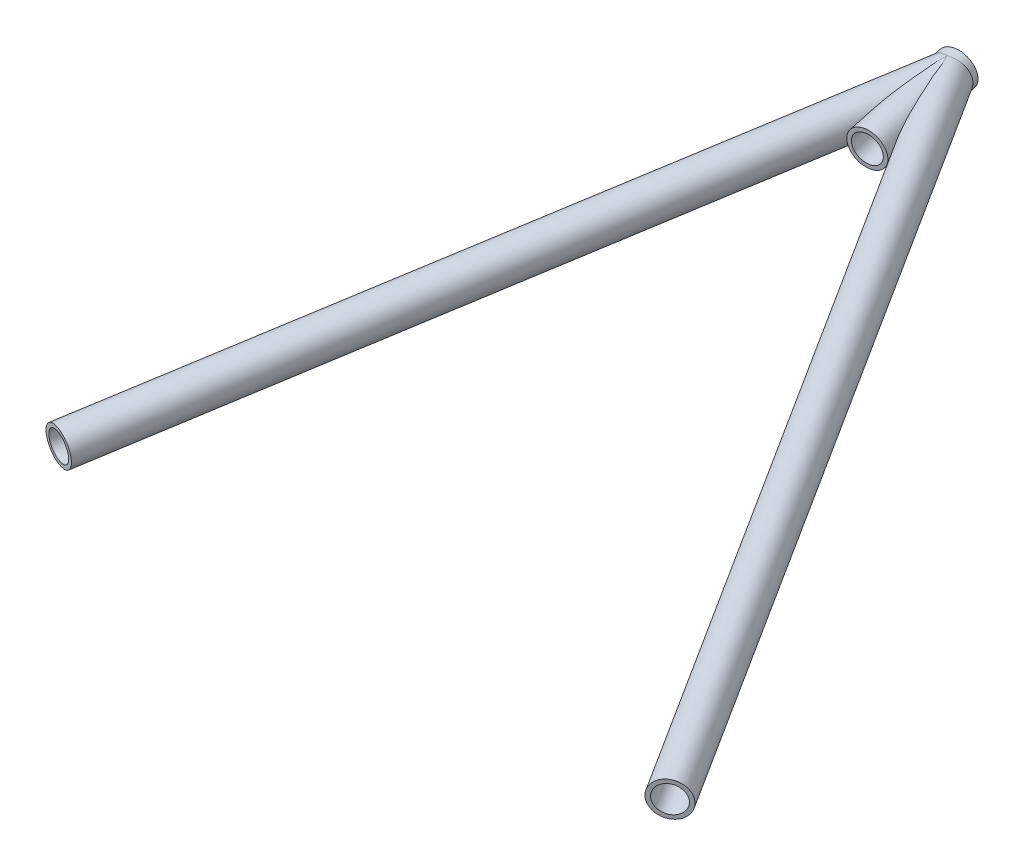
ISO-10303-21;
HEADER;
FILE_DESCRIPTION(('STEP AP214'),'2;1');
FILE_NAME('part.step','',(''),(''),'','','');
FILE_SCHEMA(('AUTOMOTIVE_DESIGN { 1 0 10303 214 1 1 1 1 }'));
ENDSEC;
DATA;
#1=APPLICATION_CONTEXT('core data for automotive mechanical design processes');
#2=APPLICATION_PROTOCOL_DEFINITION('international standard','automotive_design',2000,#1);
#3=PRODUCT_CONTEXT('',#1,'mechanical');
#4=PRODUCT('Part','Part','',(#3));
#5=PRODUCT_RELATED_PRODUCT_CATEGORY('part','',(#4));
#6=PRODUCT_DEFINITION_FORMATION('','',#4);
#7=PRODUCT_DEFINITION_CONTEXT('part definition',#1,'design');
#8=PRODUCT_DEFINITION('design','',#6,#7);
#9=PRODUCT_DEFINITION_SHAPE('','',#8);
#10=(LENGTH_UNIT() NAMED_UNIT(*) SI_UNIT(.MILLI.,.METRE.));
#11=(NAMED_UNIT(*) PLANE_ANGLE_UNIT() SI_UNIT($,.RADIAN.));
#12=(NAMED_UNIT(*) SI_UNIT($,.STERADIAN.) SOLID_ANGLE_UNIT());
#13=UNCERTAINTY_MEASURE_WITH_UNIT(LENGTH_MEASURE(1.E-05),#10,'distance_accuracy_value','');
#14=(GEOMETRIC_REPRESENTATION_CONTEXT(3) GLOBAL_UNCERTAINTY_ASSIGNED_CONTEXT((#13)) GLOBAL_UNIT_ASSIGNED_CONTEXT((#10,
#11,#12)) REPRESENTATION_CONTEXT('',''));
#15=CARTESIAN_POINT('',(0.,0.,0.));
#16=DIRECTION('',(0.,0.,1.));
#17=DIRECTION('',(1.,0.,0.));
#18=AXIS2_PLACEMENT_3D('',#15,#16,#17);
#19=CARTESIAN_POINT('',(1713.17260085528,131.13395858879,-611.724588998966));
#20=DIRECTION('',(0.512976736373104,-0.08229223970805,0.854448860508241));
#21=DIRECTION('',(0.857356807637054,0.,-0.514722550893585));
#22=AXIS2_PLACEMENT_3D('',#19,#20,#21);
#23=CYLINDRICAL_SURFACE('',#22,7.41680000000008);
#24=CARTESIAN_POINT('',(1932.04581422694,96.0220993887043,-247.154513007892));
#25=DIRECTION('',(-0.512976736373104,0.08229223970805,-0.854448860508241));
#26=DIRECTION('',(-0.857356807637054,0.,0.514722550893586));
#27=AXIS2_PLACEMENT_3D('',#24,#25,#26);
#28=CIRCLE('',#27,7.41680000000008);
#29=CARTESIAN_POINT('',(1925.68697025606,96.0220993887043,-243.336918792425));
#30=VERTEX_POINT('',#29);
#31=EDGE_CURVE('E107',#30,#30,#28,.T.);
#32=ORIENTED_EDGE('',*,*,#31,.F.);
#33=EDGE_LOOP('',(#32));
#34=FACE_BOUND('',#33,.T.);
#35=CARTESIAN_POINT('',(1723.05245629101,130.569114417633,-609.67734759782));
#36=CARTESIAN_POINT('',(1723.04654033207,130.377313286253,-609.687200454973));
#37=CARTESIAN_POINT('',(1723.03558764211,130.185341941127,-609.69093369608));
#38=CARTESIAN_POINT('',(1723.00385380998,129.802365240826,-609.685933915555));
#39=CARTESIAN_POINT('',(1722.98307189629,129.611359962669,-609.677199915247));
#40=CARTESIAN_POINT('',(1722.93212499311,129.231534671491,-609.646968784082));
#41=CARTESIAN_POINT('',(1722.90195592902,129.042715644421,-609.625466107161));
#42=CARTESIAN_POINT('',(1722.83291511719,128.668650539318,-609.569351607622));
#43=CARTESIAN_POINT('',(1722.79404354829,128.483404387946,-609.534740054384));
#44=CARTESIAN_POINT('',(1722.70843547749,128.117462600462,-609.451961973841));
#45=CARTESIAN_POINT('',(1722.66168551312,127.936775372678,-609.403772147867));
#46=CARTESIAN_POINT('',(1722.56153597079,127.581583555824,-609.293487379942));
#47=CARTESIAN_POINT('',(1722.50813634281,127.407079013274,-609.231392333392));
#48=CARTESIAN_POINT('',(1722.39615048155,127.065633452883,-609.093018034236));
#49=CARTESIAN_POINT('',(1722.33756721158,126.898688195146,-609.016746858512));
#50=CARTESIAN_POINT('',(1722.2168725192,126.573493043463,-608.849811285011));
#51=CARTESIAN_POINT('',(1722.15476126118,126.4152427451,-608.75914755742));
#52=CARTESIAN_POINT('',(1722.03096793333,126.113581909962,-608.566666492679));
#53=CARTESIAN_POINT('',(1721.9693382336,125.969855341315,-608.465310775417));
#54=CARTESIAN_POINT('',(1721.84639402671,125.69246511348,-608.249490273213));
#55=CARTESIAN_POINT('',(1721.78507950636,125.558801029791,-608.135026041785));
#56=CARTESIAN_POINT('',(1721.6646334476,125.302229610049,-607.893701630239));
#57=CARTESIAN_POINT('',(1721.605500971,125.179317619152,-607.766846865136));
#58=CARTESIAN_POINT('',(1721.49109552052,124.944525445904,-607.501715808001));
#59=CARTESIAN_POINT('',(1721.43582251283,124.832645166901,-607.363439616053));
#60=CARTESIAN_POINT('',(1721.33272886828,124.62429339617,-607.08269192494));
#61=CARTESIAN_POINT('',(1721.28469512182,124.527377197724,-606.940627421208));
#62=CARTESIAN_POINT('',(1721.1944119778,124.343384449913,-606.648543716566));
#63=CARTESIAN_POINT('',(1721.15216235441,124.256307516429,-606.498524826525));
#64=CARTESIAN_POINT('',(1721.07401202636,124.091430651227,-606.191864833834));
#65=CARTESIAN_POINT('',(1721.03811255351,124.013632520363,-606.035222453641));
#66=CARTESIAN_POINT('',(1720.97290333528,123.866616183222,-605.716645225286));
#67=CARTESIAN_POINT('',(1720.94359437323,123.79739899727,-605.55470975063));
#68=CARTESIAN_POINT('',(1720.8723843643,123.618606141324,-605.105911152147));
#69=CARTESIAN_POINT('',(1720.8371028269,123.516842924207,-604.814860950483));
#70=CARTESIAN_POINT('',(1720.78486574778,123.332410416336,-604.225156376746));
#71=CARTESIAN_POINT('',(1720.76792462366,123.249756187447,-603.926496210882));
#72=CARTESIAN_POINT('',(1720.75001694083,123.099486354441,-603.323894738933));
#73=CARTESIAN_POINT('',(1720.74910718808,123.031925065264,-603.019938471706));
#74=CARTESIAN_POINT('',(1720.75800604177,122.939832762813,-602.562493183076));
#75=CARTESIAN_POINT('',(1720.76268164796,122.910680083328,-602.409779309495));
#76=CARTESIAN_POINT('',(1720.77516899961,122.855135393918,-602.103974616504));
#77=CARTESIAN_POINT('',(1720.78298075231,122.82874339037,-601.950883796225));
#78=CARTESIAN_POINT('',(1720.80739152397,122.762324185192,-601.546358914043));
#79=CARTESIAN_POINT('',(1720.8264142541,122.724388011887,-601.294726988632));
#80=CARTESIAN_POINT('',(1720.87111220495,122.65413671667,-600.791254220738));
#81=CARTESIAN_POINT('',(1720.8967883909,122.621822411471,-600.539413353232));
#82=CARTESIAN_POINT('',(1720.95389437639,122.561995653237,-600.035689549966));
#83=CARTESIAN_POINT('',(1720.9853271153,122.534485667431,-599.783806658695));
#84=CARTESIAN_POINT('',(1721.05316611682,122.48365476674,-599.280282222038));
#85=CARTESIAN_POINT('',(1721.08957269973,122.460334121856,-599.028640693247));
#86=CARTESIAN_POINT('',(1721.20541931619,122.395777024535,-598.273050362963));
#87=CARTESIAN_POINT('',(1721.2913459101,122.360080490864,-597.769617080901));
#88=CARTESIAN_POINT('',(1721.47626198241,122.300612219466,-596.764658809902));
#89=CARTESIAN_POINT('',(1721.57524807191,122.27683739574,-596.263133360506));
#90=CARTESIAN_POINT('',(1721.78436439084,122.23932364899,-595.256904932338));
#91=CARTESIAN_POINT('',(1721.89459453669,122.225685601338,-594.752219132698));
#92=CARTESIAN_POINT('',(1722.12312635943,122.207789909182,-593.744498828002));
#93=CARTESIAN_POINT('',(1722.24142849574,122.203532799068,-593.241464418647));
#94=CARTESIAN_POINT('',(1722.48418017973,122.203856314525,-592.237913525998));
#95=CARTESIAN_POINT('',(1722.60861748857,122.208419987753,-591.737394062699));
#96=CARTESIAN_POINT('',(1722.86255967634,122.226169051773,-590.737814713578));
#97=CARTESIAN_POINT('',(1722.99206442808,122.239354226298,-590.238754791459));
#98=CARTESIAN_POINT('',(1723.28100577327,122.277897595185,-589.143972763658));
#99=CARTESIAN_POINT('',(1723.44131906471,122.305140156573,-588.548547422757));
#100=CARTESIAN_POINT('',(1723.76638569234,122.372789546001,-587.359614267569));
#101=CARTESIAN_POINT('',(1723.93113933475,122.413197284102,-586.766106588708));
#102=CARTESIAN_POINT('',(1724.26445112291,122.508571585529,-585.579406274474));
#103=CARTESIAN_POINT('',(1724.43301911512,122.563581033968,-584.986219810543));
#104=CARTESIAN_POINT('',(1724.77245515445,122.690081235806,-583.802371953746));
#105=CARTESIAN_POINT('',(1724.9433227723,122.761568952329,-583.211710116006));
#106=CARTESIAN_POINT('',(1725.28395037135,122.922852028021,-582.041913127049));
#107=CARTESIAN_POINT('',(1725.45369071435,123.012368096081,-581.46273469764));
#108=CARTESIAN_POINT('',(1725.70854870001,123.164262049089,-580.596887974645));
#109=CARTESIAN_POINT('',(1725.79357651002,123.217854859657,-580.308645039762));
#110=CARTESIAN_POINT('',(1725.96352599184,123.331737476364,-579.733454324624));
#111=CARTESIAN_POINT('',(1726.04844766716,123.392027054658,-579.446506500651));
#112=CARTESIAN_POINT('',(1726.21759670224,123.520037674093,-578.875547402489));
#113=CARTESIAN_POINT('',(1726.30182546207,123.587723554968,-578.591528703547));
#114=CARTESIAN_POINT('',(1726.4697104338,123.732098336937,-578.025622766102));
#115=CARTESIAN_POINT('',(1726.55336669129,123.808786512203,-577.743735357707));
#116=CARTESIAN_POINT('',(1726.71963907114,123.972912544411,-577.183196215688));
#117=CARTESIAN_POINT('',(1726.80225637319,124.060336709565,-576.904540846769));
#118=CARTESIAN_POINT('',(1726.96599963226,124.248574245335,-576.351380074664));
#119=CARTESIAN_POINT('',(1727.04712620244,124.349381964134,-576.076872973887));
#120=CARTESIAN_POINT('',(1727.14692251124,124.486025341449,-575.7380825857));
#121=CARTESIAN_POINT('',(1727.16671393903,124.513758726626,-575.670838503921));
#122=CARTESIAN_POINT('',(1727.2061294634,124.570382912259,-575.536787143864));
#123=CARTESIAN_POINT('',(1727.22575355519,124.599273745869,-575.469979878162));
#124=CARTESIAN_POINT('',(1727.28435196274,124.687820610514,-575.270262488974));
#125=CARTESIAN_POINT('',(1727.32304337925,124.749338742417,-575.138087416282));
#126=CARTESIAN_POINT('',(1727.39949081988,124.878245939998,-574.876121609656));
#127=CARTESIAN_POINT('',(1727.43724569603,124.945641793731,-574.746333847873));
#128=CARTESIAN_POINT('',(1727.51142644802,125.087293794141,-574.490227519062));
#129=CARTESIAN_POINT('',(1727.54785266501,125.161548162237,-574.363908063578));
#130=CARTESIAN_POINT('',(1727.63481611861,125.353286830789,-574.060510914929));
#131=CARTESIAN_POINT('',(1727.68440958377,125.475291895177,-573.885893473436));
#132=CARTESIAN_POINT('',(1727.75415421182,125.675294202062,-573.63650875239));
#133=CARTESIAN_POINT('',(1727.77661234912,125.744732936298,-573.555529408285));
#134=CARTESIAN_POINT('',(1727.81948762507,125.890180182632,-573.399161870165));
#135=CARTESIAN_POINT('',(1727.83990627244,125.966183759572,-573.323769553939));
#136=CARTESIAN_POINT('',(1727.88002988058,126.133948103504,-573.173052164775));
#137=CARTESIAN_POINT('',(1727.89944210014,126.226525571001,-573.098542132831));
#138=CARTESIAN_POINT('',(1727.93372089541,126.421592146569,-572.962511865748));
#139=CARTESIAN_POINT('',(1727.94859396864,126.524066807959,-572.900973102462));
#140=CARTESIAN_POINT('',(1727.9703688576,126.721305130092,-572.804172833107));
#141=CARTESIAN_POINT('',(1727.9781683592,126.814655300222,-572.766276163256));
#142=CARTESIAN_POINT('',(1727.9886360929,127.006497014591,-572.705943546994));
#143=CARTESIAN_POINT('',(1727.99131000185,127.104982746569,-572.683490513701));
#144=CARTESIAN_POINT('',(1727.99110333081,127.30466275826,-572.655718258056));
#145=CARTESIAN_POINT('',(1727.98820592868,127.405864328365,-572.650451056551));
#146=CARTESIAN_POINT('',(1727.97707313307,127.607437401087,-572.656874898471));
#147=CARTESIAN_POINT('',(1727.96883271801,127.707808032787,-572.66858190779));
#148=CARTESIAN_POINT('',(1727.94506210844,127.93076355568,-572.711846518752));
#149=CARTESIAN_POINT('',(1727.92819322461,128.052335118458,-572.747775707289));
#150=CARTESIAN_POINT('',(1727.88912348547,128.287701845822,-572.837620625341));
#151=CARTESIAN_POINT('',(1727.86691075087,128.401478949115,-572.89157653333));
#152=CARTESIAN_POINT('',(1727.82203384034,128.605973058439,-573.004270539063));
#153=CARTESIAN_POINT('',(1727.79983990089,128.697724245082,-573.061366303878));
#154=CARTESIAN_POINT('',(1727.75337965479,128.875670381991,-573.182972871904));
#155=CARTESIAN_POINT('',(1727.72911168024,128.96186076074,-573.247489657656));
#156=CARTESIAN_POINT('',(1727.67898802284,129.129385125038,-573.382324532379));
#157=CARTESIAN_POINT('',(1727.65312877933,129.210707352104,-573.45265576215));
#158=CARTESIAN_POINT('',(1727.60025467923,129.368843032192,-573.597718249923));
#159=CARTESIAN_POINT('',(1727.57324020902,129.445657972714,-573.672448039813));
#160=CARTESIAN_POINT('',(1727.50400492049,129.634361753042,-573.865271202049));
#161=CARTESIAN_POINT('',(1727.46119471828,129.743672367138,-573.985671502339));
#162=CARTESIAN_POINT('',(1727.37412769178,129.954798805285,-574.23241613044));
#163=CARTESIAN_POINT('',(1727.32987010012,130.056610557549,-574.358763627362));
#164=CARTESIAN_POINT('',(1727.24024816083,130.25407673097,-574.616167440291));
#165=CARTESIAN_POINT('',(1727.19488196415,130.349719737163,-574.747231824044));
#166=CARTESIAN_POINT('',(1727.10339164071,130.535605791726,-575.012882962832));
#167=CARTESIAN_POINT('',(1727.05726742402,130.625848193371,-575.147470136961));
#168=CARTESIAN_POINT('',(1726.96419798409,130.802161088826,-575.420224465398));
#169=CARTESIAN_POINT('',(1726.91724960088,130.888205239722,-575.558407506878));
#170=CARTESIAN_POINT('',(1726.82292803408,131.056178552793,-575.837109482565));
#171=CARTESIAN_POINT('',(1726.77555483459,131.138107560182,-575.977628504372));
#172=CARTESIAN_POINT('',(1726.68055076136,131.298234146016,-576.260438223727));
#173=CARTESIAN_POINT('',(1726.63292027664,131.376436193937,-576.402726527262));
#174=CARTESIAN_POINT('',(1726.53742703123,131.529605487745,-576.688947920995));
#175=CARTESIAN_POINT('',(1726.48956427451,131.604572788616,-576.832880983182));
#176=CARTESIAN_POINT('',(1726.34499967611,131.826243070369,-577.26898865864));
#177=CARTESIAN_POINT('',(1726.24803946553,131.968518096491,-577.563333408426));
#178=CARTESIAN_POINT('',(1726.05382647221,132.243381675934,-578.156436015282));
#179=CARTESIAN_POINT('',(1725.95657364764,132.375968768313,-578.455194529816));
#180=CARTESIAN_POINT('',(1725.76201376865,132.63297044007,-579.056367004211));
#181=CARTESIAN_POINT('',(1725.664706711,132.757380986967,-579.358782681936));
#182=CARTESIAN_POINT('',(1725.47029788569,132.999071352768,-579.966525491397));
#183=CARTESIAN_POINT('',(1725.37319612925,133.116350791504,-580.271852777352));
#184=CARTESIAN_POINT('',(1725.17915207025,133.344893093205,-580.885695794895));
#185=CARTESIAN_POINT('',(1725.08221069603,133.45614098482,-581.194217382211));
#186=CARTESIAN_POINT('',(1724.88888063237,133.672983142699,-581.813416551023));
#187=CARTESIAN_POINT('',(1724.79249195817,133.778577253542,-582.124094191524));
#188=CARTESIAN_POINT('',(1724.50444502648,134.087634640036,-583.058790705019));
#189=CARTESIAN_POINT('',(1724.31384217685,134.283446981898,-583.68567433358));
#190=CARTESIAN_POINT('',(1723.93686895751,134.657541361915,-584.945229958343));
#191=CARTESIAN_POINT('',(1723.7504950605,134.835838456078,-585.57789646304));
#192=CARTESIAN_POINT('',(1723.38318939233,135.177001527154,-586.849006701281));
#193=CARTESIAN_POINT('',(1723.20225810942,135.339866122437,-587.487450946495));
#194=CARTESIAN_POINT('',(1722.84786708533,135.651005369213,-588.768918344349));
#195=CARTESIAN_POINT('',(1722.67439715532,135.799300296471,-589.411933758914));
#196=CARTESIAN_POINT('',(1722.33699000706,136.08188502393,-590.703475440731));
#197=CARTESIAN_POINT('',(1722.17305190343,136.216176125836,-591.352001189706));
#198=CARTESIAN_POINT('',(1721.88774876259,136.446209178538,-592.531832471643));
#199=CARTESIAN_POINT('',(1721.76419403631,136.544439536494,-593.062122762843));
#200=CARTESIAN_POINT('',(1721.5278832215,136.730521618372,-594.127113710472));
#201=CARTESIAN_POINT('',(1721.41513000987,136.818370578741,-594.66181550091));
#202=CARTESIAN_POINT('',(1721.25669485208,136.941078243437,-595.467259549226));
#203=CARTESIAN_POINT('',(1721.20567214448,136.980464823488,-595.73626719979));
#204=CARTESIAN_POINT('',(1721.10774431697,137.055894834217,-596.275494325697));
#205=CARTESIAN_POINT('',(1721.06083905378,137.091938381242,-596.545713758522));
#206=CARTESIAN_POINT('',(1720.97180059786,137.160265669107,-597.087351620025));
#207=CARTESIAN_POINT('',(1720.92966628007,137.192550296421,-597.358769750276));
#208=CARTESIAN_POINT('',(1720.85094140363,137.25281788767,-597.902876119974));
#209=CARTESIAN_POINT('',(1720.81435057926,137.280801057791,-598.175564297895));
#210=CARTESIAN_POINT('',(1720.73779935068,137.339270311498,-598.802815188736));
#211=CARTESIAN_POINT('',(1720.70002641696,137.368061687218,-599.157812427505));
#212=CARTESIAN_POINT('',(1720.63780007058,137.415104339226,-599.86980885644));
#213=CARTESIAN_POINT('',(1720.61334964995,137.433353247891,-600.226808478138));
#214=CARTESIAN_POINT('',(1720.58089412748,137.456182895289,-600.941543828652));
#215=CARTESIAN_POINT('',(1720.57286492241,137.460783671366,-601.299277705975));
#216=CARTESIAN_POINT('',(1720.57684445117,137.451995329802,-602.014412921783));
#217=CARTESIAN_POINT('',(1720.5888405537,137.438617553472,-602.371814327721));
#218=CARTESIAN_POINT('',(1720.62728094086,137.397812353018,-602.94364577828));
#219=CARTESIAN_POINT('',(1720.64620477468,137.377961852585,-603.159123716042));
#220=CARTESIAN_POINT('',(1720.69358362457,137.327727439894,-603.587771761716));
#221=CARTESIAN_POINT('',(1720.72203547175,137.297347029626,-603.800942612632));
#222=CARTESIAN_POINT('',(1720.78890795805,137.224303600442,-604.22326985497));
#223=CARTESIAN_POINT('',(1720.82731262239,137.181660252263,-604.432432107867));
#224=CARTESIAN_POINT('',(1720.91415266722,137.082230302288,-604.845262561577));
#225=CARTESIAN_POINT('',(1720.96258603365,137.025446539838,-605.04893185627));
#226=CARTESIAN_POINT('',(1721.0606234992,136.906114628933,-605.417674337204));
#227=CARTESIAN_POINT('',(1721.10888200087,136.845824944191,-605.583835973428));
#228=CARTESIAN_POINT('',(1721.21131376055,136.713201416826,-605.909379685184));
#229=CARTESIAN_POINT('',(1721.26548584339,136.640869965699,-606.068763098999));
#230=CARTESIAN_POINT('',(1721.37857583728,136.483680020401,-606.379497782779));
#231=CARTESIAN_POINT('',(1721.43749415951,136.39882044037,-606.530848354961));
#232=CARTESIAN_POINT('',(1721.55856778639,136.216468401279,-606.824379270386));
#233=CARTESIAN_POINT('',(1721.62072316975,136.118975634999,-606.966559390491));
#234=CARTESIAN_POINT('',(1721.74662469165,135.91150064187,-607.241009108491));
#235=CARTESIAN_POINT('',(1721.81037246232,135.8015051529,-607.373267931014));
#236=CARTESIAN_POINT('',(1721.93760793841,135.569674836324,-607.627100692577));
#237=CARTESIAN_POINT('',(1722.00109563875,135.447839778569,-607.748674423824));
#238=CARTESIAN_POINT('',(1722.12611174923,135.193063895975,-607.980851517193));
#239=CARTESIAN_POINT('',(1722.18763896734,135.060116486008,-608.091448288288));
#240=CARTESIAN_POINT('',(1722.30709748487,134.78415020043,-608.301439824914));
#241=CARTESIAN_POINT('',(1722.36502878167,134.641131317514,-608.400834582319));
#242=CARTESIAN_POINT('',(1722.475145828,134.34807553776,-608.5871495931));
#243=CARTESIAN_POINT('',(1722.52739826433,134.198158618163,-608.674219388284));
#244=CARTESIAN_POINT('',(1722.6258899732,133.890641347062,-608.837505815819));
#245=CARTESIAN_POINT('',(1722.67212924149,133.733040990139,-608.913722440514));
#246=CARTESIAN_POINT('',(1722.75763864707,133.41130052742,-609.055370803047));
#247=CARTESIAN_POINT('',(1722.79691065637,133.247162192851,-609.12080543753));
#248=CARTESIAN_POINT('',(1722.86775060106,132.913411083176,-609.240995818702));
#249=CARTESIAN_POINT('',(1722.89931876247,132.743798468842,-609.295751878676));
#250=CARTESIAN_POINT('',(1722.95254974927,132.410446891782,-609.391690965734));
#251=CARTESIAN_POINT('',(1722.9746908399,132.246960449564,-609.433488491917));
#252=CARTESIAN_POINT('',(1723.01133528768,131.916973562253,-609.507713074967));
#253=CARTESIAN_POINT('',(1723.02583615056,131.750472151215,-609.540137070176));
#254=CARTESIAN_POINT('',(1723.0469838483,131.415397173538,-609.595571402671));
#255=CARTESIAN_POINT('',(1723.05362981834,131.246823380796,-609.61858070323));
#256=CARTESIAN_POINT('',(1723.05898350411,130.908582098071,-609.655106001696));
#257=CARTESIAN_POINT('',(1723.05769365864,130.738914960097,-609.668624914709));
#258=CARTESIAN_POINT('',(1723.05245629101,130.569114417633,-609.67734759782));
#259=B_SPLINE_CURVE_WITH_KNOTS('',3,(#35,#36,#37,#38,#39,#40,#41,#42,#43,#44,#45,#46,#47,#48,
#49,#50,#51,#52,#53,#54,#55,#56,#57,#58,#59,#60,#61,#62,#63,#64,#65,#66,#67,#68,#69,#70,#71,#72,
#73,#74,#75,#76,#77,#78,#79,#80,#81,#82,#83,#84,#85,#86,#87,#88,#89,#90,#91,#92,#93,#94,#95,#96,
#97,#98,#99,#100,#101,#102,#103,#104,#105,#106,#107,#108,#109,#110,#111,#112,#113,#114,#115,
#116,#117,#118,#119,#120,#121,#122,#123,#124,#125,#126,#127,#128,#129,#130,#131,#132,#133,#134,
#135,#136,#137,#138,#139,#140,#141,#142,#143,#144,#145,#146,#147,#148,#149,#150,#151,#152,#153,
#154,#155,#156,#157,#158,#159,#160,#161,#162,#163,#164,#165,#166,#167,#168,#169,#170,#171,#172,
#173,#174,#175,#176,#177,#178,#179,#180,#181,#182,#183,#184,#185,#186,#187,#188,#189,#190,#191,
#192,#193,#194,#195,#196,#197,#198,#199,#200,#201,#202,#203,#204,#205,#206,#207,#208,#209,#210,
#211,#212,#213,#214,#215,#216,#217,#218,#219,#220,#221,#222,#223,#224,#225,#226,#227,#228,#229,
#230,#231,#232,#233,#234,#235,#236,#237,#238,#239,#240,#241,#242,#243,#244,#245,#246,#247,#248,
#249,#250,#251,#252,#253,#254,#255,#256,#257,#258),.UNSPECIFIED.,.T.,.F.,(4,2,2,2,2,2,2,2,2,2,2,
2,2,2,2,2,2,2,2,2,2,2,2,2,2,2,2,2,2,2,2,2,2,2,2,2,2,2,2,2,2,2,2,2,2,2,2,2,2,2,2,2,2,2,2,2,2,2,2,
2,2,2,2,2,2,2,2,2,2,2,2,2,2,2,2,2,2,2,2,2,2,2,2,2,2,2,2,2,2,2,2,2,2,2,2,2,2,2,2,2,2,2,2,2,2,2,2,
2,2,2,2,4),(0.,0.5762905985785,1.15262643841304,1.72921279252587,2.30578729873162,
2.88335722553767,3.46093149720245,4.03817769780171,4.6153970269364,5.17374293840111,
5.73206528202877,6.2901447054839,6.84821923902869,7.38332139769753,7.91840265917229,
8.45358760228693,8.98883612112741,9.91821558798152,10.8483251209369,11.7817297668767,
12.248312295847,12.7148959022911,13.4802640933417,14.2457433798635,15.0116146248162,
15.7775352122352,17.3129644784832,18.8479960853233,20.3981061111411,21.9483044373709,
23.4955264560109,25.0427096648364,26.894241564471,28.7459014807718,30.6030610640594,
32.459878653906,34.289881738979,35.2056127640783,36.1213126427637,37.0328347320155,
37.9442833782823,38.8545814805171,39.7644963833476,39.9906376729429,40.2167854445226,
40.6691835878372,41.1221112955511,41.5749218759369,42.2294771016718,42.5562421436365,
42.8827636411422,43.2430896948133,43.602897517992,43.9047945559671,44.2063570346246,
44.5088314885144,44.8115906336242,45.1931073454155,45.5754801293267,45.9059684843568,
46.2367251587558,46.5682509340919,46.8996666764028,47.4037574122136,47.9081198753821,
48.4133903378055,48.9187211861735,49.426896527911,49.9350909696096,50.4426597895652,
50.9502199783058,51.972994654346,52.9959232479572,54.0193525981185,55.0428364607878,
56.0687542821779,57.0947002915324,59.145921824268,61.1953644200527,63.2449903239969,
65.2917222326139,67.3382637204383,68.9979468942732,70.6580708895933,71.4878942705656,
72.3176887604122,73.1472871597566,73.9768457805912,75.0509957550787,76.1253868682501,
77.1981998442995,78.2703363812202,78.9215935251996,79.5726342845615,80.2226364925022,
80.8725082872918,81.4216289862148,81.9706407594928,82.5197001456041,83.068772886459,
83.6184335829981,84.1681049664559,84.7181044239535,85.2681042804134,85.8107211981469,
86.3533384986249,86.8958097832951,87.4382651506712,87.9483864345856,88.4586741506583,
88.9690180434485,89.4792051083131),.UNSPECIFIED.);
#260=CARTESIAN_POINT('',(1723.05245629101,130.569114417633,-609.67734759782));
#261=VERTEX_POINT('',#260);
#262=EDGE_CURVE('E81',#261,#261,#259,.T.);
#263=ORIENTED_EDGE('',*,*,#262,.T.);
#264=EDGE_LOOP('',(#263));
#265=FACE_BOUND('',#264,.T.);
#266=ADVANCED_FACE('F63',(#34,#265),#23,.F.);
#267=CARTESIAN_POINT('',(1719.75176820433,126.102654339161,-562.415355233465));
#268=DIRECTION('',(-0.131583346980973,0.100626084992588,-0.98618467531003));
#269=DIRECTION('',(-0.991215775128284,0.,0.132254629925897));
#270=AXIS2_PLACEMENT_3D('',#267,#268,#269);
#271=CYLINDRICAL_SURFACE('',#270,9.52500000000004);
#272=ORIENTED_EDGE('',*,*,#262,.F.);
#273=EDGE_LOOP('',(#272));
#274=FACE_BOUND('',#273,.T.);
#275=CARTESIAN_POINT('',(1713.17260085528,131.13395858879,-611.724588998964));
#276=DIRECTION('',(0.944230002344393,0.0453897924229676,-0.326143326493902));
#277=DIRECTION('',(0.329060742994004,-0.0933834430453637,0.93968003064087));
#278=AXIS2_PLACEMENT_3D('',#275,#276,#277);
#279=ELLIPSE('',#278,47.1628036692757,9.525);
#280=CARTESIAN_POINT('',(1713.28876294306,121.660440805419,-612.706725536065));
#281=VERTEX_POINT('',#280);
#282=CARTESIAN_POINT('',(1713.05643876749,140.607476372162,-610.742452461863));
#283=VERTEX_POINT('',#282);
#284=EDGE_CURVE('E72',#281,#283,#279,.F.);
#285=ORIENTED_EDGE('',*,*,#284,.T.);
#286=CARTESIAN_POINT('',(1713.17260085528,131.13395858879,-611.724588998964));
#287=DIRECTION('',(0.329060742994004,-0.0933834430453637,0.93968003064087));
#288=DIRECTION('',(0.944230002344393,0.0453897924229676,-0.326143326493902));
#289=AXIS2_PLACEMENT_3D('',#286,#287,#288);
#290=ELLIPSE('',#289,9.72540390868764,9.525);
#291=EDGE_CURVE('E13',#283,#281,#290,.F.);
#292=ORIENTED_EDGE('',*,*,#291,.T.);
#293=EDGE_LOOP('',(#285,#292));
#294=FACE_BOUND('',#293,.T.);
#295=ADVANCED_FACE('F79',(#274,#294),#271,.F.);
#296=CARTESIAN_POINT('',(1713.17260085528,131.13395858879,-611.724588998966));
#297=DIRECTION('',(0.512976736373104,-0.08229223970805,0.854448860508241));
#298=DIRECTION('',(0.857356807637054,0.,-0.514722550893585));
#299=AXIS2_PLACEMENT_3D('',#296,#297,#298);
#300=CYLINDRICAL_SURFACE('',#299,9.52499999999996);
#301=CARTESIAN_POINT('',(1932.04581422694,96.0220993887043,-247.154513007892));
#302=DIRECTION('',(-0.512976736373104,0.08229223970805,-0.854448860508241));
#303=DIRECTION('',(-0.857356807637054,0.,0.514722550893586));
#304=AXIS2_PLACEMENT_3D('',#301,#302,#303);
#305=CIRCLE('',#304,9.52499999999996);
#306=CARTESIAN_POINT('',(1923.8794906342,96.0220993887043,-242.251780710631));
#307=VERTEX_POINT('',#306);
#308=EDGE_CURVE('E67',#307,#307,#305,.T.);
#309=ORIENTED_EDGE('',*,*,#308,.T.);
#310=EDGE_LOOP('',(#309));
#311=FACE_BOUND('',#310,.T.);
#312=ORIENTED_EDGE('',*,*,#284,.F.);
#313=ORIENTED_EDGE('',*,*,#291,.F.);
#314=EDGE_LOOP('',(#312,#313));
#315=FACE_BOUND('',#314,.T.);
#316=ADVANCED_FACE('F65',(#311,#315),#300,.T.);
#317=CARTESIAN_POINT('',(1932.04581422694,96.0220993887044,-247.154513007892));
#318=DIRECTION('',(-0.512976736373104,0.08229223970805,-0.854448860508241));
#319=DIRECTION('',(-0.857356807637054,0.,0.514722550893586));
#320=AXIS2_PLACEMENT_3D('',#317,#318,#319);
#321=PLANE('',#320);
#322=ORIENTED_EDGE('',*,*,#31,.T.);
#323=EDGE_LOOP('',(#322));
#324=FACE_BOUND('',#323,.T.);
#325=ORIENTED_EDGE('',*,*,#308,.F.);
#326=EDGE_LOOP('',(#325));
#327=FACE_BOUND('',#326,.T.);
#328=ADVANCED_FACE('F84',(#324,#327),#321,.F.);
#329=CLOSED_SHELL('',(#266,#295,#316,#328));
#330=MANIFOLD_SOLID_BREP('B2',#329);
#331=CARTESIAN_POINT('',(1600.,88.8502518080079,-217.248802890104));
#332=DIRECTION('',(0.274316838299431,0.102490644096067,-0.956162088820811));
#333=DIRECTION('',(-0.961223924389069,0.,-0.275769046816492));
#334=AXIS2_PLACEMENT_3D('',#331,#332,#333);
#335=CYLINDRICAL_SURFACE('',#334,7.41680000000008);
#336=CARTESIAN_POINT('',(1609.60108934048,92.4374243513702,-250.714475998832));
#337=DIRECTION('',(0.274316838299431,0.102490644096067,-0.956162088820811));
#338=DIRECTION('',(-0.96122392438907,0.,-0.275769046816492));
#339=AXIS2_PLACEMENT_3D('',#336,#337,#338);
#340=CIRCLE('',#339,7.41680000000008);
#341=CARTESIAN_POINT('',(1602.47188373807,92.4374243513702,-252.759799865261));
#342=VERTEX_POINT('',#341);
#343=EDGE_CURVE('E161',#342,#342,#340,.T.);
#344=ORIENTED_EDGE('',*,*,#343,.F.);
#345=EDGE_LOOP('',(#344));
#346=FACE_BOUND('',#345,.T.);
#347=CARTESIAN_POINT('',(1704.16915790004,130.433703385095,-607.237048483694));
#348=CARTESIAN_POINT('',(1704.16399077324,130.626588998975,-607.219033881927));
#349=CARTESIAN_POINT('',(1704.16540530266,130.819281558209,-607.196394251857));
#350=CARTESIAN_POINT('',(1704.1813770738,131.202905341836,-607.141967483448));
#351=CARTESIAN_POINT('',(1704.19594213303,131.393835450306,-607.11017491168));
#352=CARTESIAN_POINT('',(1704.23805567209,131.772948573631,-607.037340005222));
#353=CARTESIAN_POINT('',(1704.26563419309,131.961124188121,-606.996276383592));
#354=CARTESIAN_POINT('',(1704.33337705444,132.332881747878,-606.904804568348));
#355=CARTESIAN_POINT('',(1704.37354129535,132.516463729427,-606.854396448566));
#356=CARTESIAN_POINT('',(1704.46585660825,132.877707098577,-606.743964816532));
#357=CARTESIAN_POINT('',(1704.51801205661,133.055366297404,-606.683937796158));
#358=CARTESIAN_POINT('',(1704.63346009951,133.403286266749,-606.553931925536));
#359=CARTESIAN_POINT('',(1704.69675315362,133.573546731618,-606.48395266466));
#360=CARTESIAN_POINT('',(1704.83331810417,133.905100084552,-606.33369454951));
#361=CARTESIAN_POINT('',(1704.90658128143,134.066400636664,-606.253424698183));
#362=CARTESIAN_POINT('',(1705.06175584714,134.378797186812,-606.082104958726));
#363=CARTESIAN_POINT('',(1705.14366685982,134.529893627774,-605.991055538972));
#364=CARTESIAN_POINT('',(1705.31230561934,134.816867969547,-605.800247785144));
#365=CARTESIAN_POINT('',(1705.39885802946,134.953035062472,-605.700769615719));
#366=CARTESIAN_POINT('',(1705.57681119888,135.213328221495,-605.490980346471));
#367=CARTESIAN_POINT('',(1705.66821180405,135.337454669997,-605.380669590911));
#368=CARTESIAN_POINT('',(1705.85382700765,135.572722291596,-605.14926990721));
#369=CARTESIAN_POINT('',(1705.94804002065,135.68387061347,-605.02818697812));
#370=CARTESIAN_POINT('',(1706.13725119627,135.892690198147,-604.775482834942));
#371=CARTESIAN_POINT('',(1706.23224932658,135.990362012752,-604.64386205268));
#372=CARTESIAN_POINT('',(1706.41567781871,136.166926011533,-604.378432153677));
#373=CARTESIAN_POINT('',(1706.50417605965,136.2465673442,-604.245166606849));
#374=CARTESIAN_POINT('',(1706.67857074584,136.393926755853,-603.970580827279));
#375=CARTESIAN_POINT('',(1706.76446696554,136.461643803552,-603.829259899254));
#376=CARTESIAN_POINT('',(1706.93239928544,136.585669705703,-603.539554155033));
#377=CARTESIAN_POINT('',(1707.0144360059,136.641980398076,-603.391170481633));
#378=CARTESIAN_POINT('',(1707.17378151406,136.744005633777,-603.088357015416));
#379=CARTESIAN_POINT('',(1707.25108965166,136.789718722529,-602.93392639602));
#380=CARTESIAN_POINT('',(1707.44038371105,136.893396174057,-602.536022305));
#381=CARTESIAN_POINT('',(1707.54878656909,136.944824515549,-602.289125749296));
#382=CARTESIAN_POINT('',(1707.75247874519,137.028694357763,-601.786850906199));
#383=CARTESIAN_POINT('',(1707.84776019078,137.061124497766,-601.531467640095));
#384=CARTESIAN_POINT('',(1708.02604618595,137.110606759745,-601.013989913246));
#385=CARTESIAN_POINT('',(1708.10900409329,137.127601643368,-600.751874149483));
#386=CARTESIAN_POINT('',(1708.22473684975,137.143669300373,-600.355899556627));
#387=CARTESIAN_POINT('',(1708.26186164549,137.147454467461,-600.223449800737));
#388=CARTESIAN_POINT('',(1708.33338801329,137.152200737703,-599.957761109431));
#389=CARTESIAN_POINT('',(1708.36778954049,137.15316179436,-599.824522161058));
#390=CARTESIAN_POINT('',(1708.44942647965,137.152409095601,-599.495357474075));
#391=CARTESIAN_POINT('',(1708.49519756677,137.14924493869,-599.299071555874));
#392=CARTESIAN_POINT('',(1708.58177429116,137.138250861155,-598.905529270086));
#393=CARTESIAN_POINT('',(1708.6225792987,137.130420349541,-598.708272782716));
#394=CARTESIAN_POINT('',(1708.73833105913,137.10090371449,-598.115329075253));
#395=CARTESIAN_POINT('',(1708.80657666361,137.073193935801,-597.718624128738));
#396=CARTESIAN_POINT('',(1708.92880515216,137.005472217018,-596.92329265206));
#397=CARTESIAN_POINT('',(1708.98275683164,136.965433767667,-596.524663821032));
#398=CARTESIAN_POINT('',(1709.07900333903,136.875603000916,-595.727216647698));
#399=CARTESIAN_POINT('',(1709.12130068036,136.825812790586,-595.328398364866));
#400=CARTESIAN_POINT('',(1709.19665096414,136.71789460621,-594.528887392476));
#401=CARTESIAN_POINT('',(1709.229654071,136.65972412103,-594.128195887418));
#402=CARTESIAN_POINT('',(1709.28786577284,136.53639965335,-593.327318825368));
#403=CARTESIAN_POINT('',(1709.31307403592,136.471245373654,-592.927133290642));
#404=CARTESIAN_POINT('',(1709.35703549867,136.334811387598,-592.127969167727));
#405=CARTESIAN_POINT('',(1709.37579658543,136.263539299838,-591.72898970094));
#406=CARTESIAN_POINT('',(1709.40798272446,136.115300086116,-590.931886776615));
#407=CARTESIAN_POINT('',(1709.4214078519,136.03833304041,-590.533763307093));
#408=CARTESIAN_POINT('',(1709.44535232465,135.867841028585,-589.682741239436));
#409=CARTESIAN_POINT('',(1709.45520070472,135.77350727581,-589.229986054807));
#410=CARTESIAN_POINT('',(1709.47009611838,135.578041760709,-588.325865483068));
#411=CARTESIAN_POINT('',(1709.47514309684,135.476909920344,-587.874500111974));
#412=CARTESIAN_POINT('',(1709.48123733788,135.267813860281,-586.973134984571));
#413=CARTESIAN_POINT('',(1709.48228296977,135.15984687323,-586.523135859689));
#414=CARTESIAN_POINT('',(1709.48101556026,134.936952248108,-585.624873086335));
#415=CARTESIAN_POINT('',(1709.47870254397,134.822024662064,-585.176609424919));
#416=CARTESIAN_POINT('',(1709.47125905446,134.585342052899,-584.283806952574));
#417=CARTESIAN_POINT('',(1709.46613975769,134.463615822409,-583.839260421789));
#418=CARTESIAN_POINT('',(1709.45352300352,134.212417720048,-582.952395991245));
#419=CARTESIAN_POINT('',(1709.44602556707,134.082945916414,-582.51007807189));
#420=CARTESIAN_POINT('',(1709.42902011134,133.815580860101,-581.62817225892));
#421=CARTESIAN_POINT('',(1709.41951269354,133.677690135479,-581.188583589016));
#422=CARTESIAN_POINT('',(1709.3988024134,133.392482792036,-580.312528587989));
#423=CARTESIAN_POINT('',(1709.38759962831,133.245166602866,-579.87606211555));
#424=CARTESIAN_POINT('',(1709.36376858887,132.939613981955,-579.006476417877));
#425=CARTESIAN_POINT('',(1709.3511388534,132.781366271231,-578.573361178472));
#426=CARTESIAN_POINT('',(1709.32472839561,132.452214573828,-577.711902588916));
#427=CARTESIAN_POINT('',(1709.31094748304,132.281308495672,-577.283560040843));
#428=CARTESIAN_POINT('',(1709.2824856646,131.924016834577,-576.43267709632));
#429=CARTESIAN_POINT('',(1709.26780361115,131.737611401591,-576.010144973707));
#430=CARTESIAN_POINT('',(1709.24535307803,131.44360636238,-575.383193369539));
#431=CARTESIAN_POINT('',(1709.23779938082,131.343219827083,-575.175378386201));
#432=CARTESIAN_POINT('',(1709.22259600485,131.136930169088,-574.762515127525));
#433=CARTESIAN_POINT('',(1709.2149463332,131.031027453257,-574.557466649533));
#434=CARTESIAN_POINT('',(1709.19958197572,130.812486671093,-574.150150827668));
#435=CARTESIAN_POINT('',(1709.19186716128,130.699828538729,-573.947894212248));
#436=CARTESIAN_POINT('',(1709.17646573949,130.466889522875,-573.547728426182));
#437=CARTESIAN_POINT('',(1709.16877913899,130.346606904276,-573.349820259013));
#438=CARTESIAN_POINT('',(1709.15355679098,130.097284230531,-572.960439697486));
#439=CARTESIAN_POINT('',(1709.146020643,129.968273100749,-572.768948914667));
#440=CARTESIAN_POINT('',(1709.13121501297,129.699110048234,-572.394007423089));
#441=CARTESIAN_POINT('',(1709.12394537501,129.558964796189,-572.210552000877));
#442=CARTESIAN_POINT('',(1709.11104641765,129.288796893708,-571.884558424602));
#443=CARTESIAN_POINT('',(1709.10534427234,129.160915215822,-571.740261186631));
#444=CARTESIAN_POINT('',(1709.09445824003,128.892439006283,-571.462837002161));
#445=CARTESIAN_POINT('',(1709.08927595944,128.751807480566,-571.329744871698));
#446=CARTESIAN_POINT('',(1709.08213007569,128.528276160041,-571.142706714198));
#447=CARTESIAN_POINT('',(1709.07983787581,128.45103771948,-571.082052743143));
#448=CARTESIAN_POINT('',(1709.07554977839,128.292251742302,-570.966694784879));
#449=CARTESIAN_POINT('',(1709.07355399578,128.210702550664,-570.911993107943));
#450=CARTESIAN_POINT('',(1709.0681548384,127.959767072271,-570.75972908204));
#451=CARTESIAN_POINT('',(1709.065303165,127.783034870399,-570.673068743499));
#452=CARTESIAN_POINT('',(1709.06280265953,127.501006269178,-570.577977996882));
#453=CARTESIAN_POINT('',(1709.06227584546,127.401661116674,-570.551941453215));
#454=CARTESIAN_POINT('',(1709.06202871023,127.200041176651,-570.516263162299));
#455=CARTESIAN_POINT('',(1709.06230739466,127.097770155653,-570.506601223144));
#456=CARTESIAN_POINT('',(1709.06375434189,126.892521792185,-570.505655074531));
#457=CARTESIAN_POINT('',(1709.06492752349,126.789543675109,-570.514472954944));
#458=CARTESIAN_POINT('',(1709.06813903563,126.586875624883,-570.550573826572));
#459=CARTESIAN_POINT('',(1709.0701779496,126.487187958168,-570.577869277676));
#460=CARTESIAN_POINT('',(1709.07538510165,126.277879401098,-570.654491044928));
#461=CARTESIAN_POINT('',(1709.07868419607,126.169334899921,-570.706710114286));
#462=CARTESIAN_POINT('',(1709.0860061731,125.96216528738,-570.827950686729));
#463=CARTESIAN_POINT('',(1709.09003043545,125.863559653822,-570.897004310085));
#464=CARTESIAN_POINT('',(1709.10126833963,125.616684612715,-571.094692138435));
#465=CARTESIAN_POINT('',(1709.10888724803,125.476532907914,-571.233355264946));
#466=CARTESIAN_POINT('',(1709.12078415506,125.28241745357,-571.454909340815));
#467=CARTESIAN_POINT('',(1709.12483569725,125.220299210549,-571.531172066318));
#468=CARTESIAN_POINT('',(1709.13305328212,125.100773974994,-571.687311120382));
#469=CARTESIAN_POINT('',(1709.13721929417,125.043365738208,-571.76718648588));
#470=CARTESIAN_POINT('',(1709.14740159504,124.909345678928,-571.964016479692));
#471=CARTESIAN_POINT('',(1709.15345703899,124.834849244756,-572.082398374398));
#472=CARTESIAN_POINT('',(1709.16565414269,124.69283069754,-572.323294712721));
#473=CARTESIAN_POINT('',(1709.17179584038,124.625311769723,-572.445811010134));
#474=CARTESIAN_POINT('',(1709.19029556483,124.431345349097,-572.818320098886));
#475=CARTESIAN_POINT('',(1709.2027090471,124.313728679373,-573.072901498175));
#476=CARTESIAN_POINT('',(1709.2275131561,124.095303870824,-573.590528941382));
#477=CARTESIAN_POINT('',(1709.23990332846,123.994586298633,-573.853612111738));
#478=CARTESIAN_POINT('',(1709.25832601988,123.85375600026,-574.251656900667));
#479=CARTESIAN_POINT('',(1709.26443672826,123.808540823862,-574.384839280693));
#480=CARTESIAN_POINT('',(1709.27659581082,123.721146624098,-574.652197439012));
#481=CARTESIAN_POINT('',(1709.28264418577,123.678967563187,-574.786373204998));
#482=CARTESIAN_POINT('',(1709.30012691268,123.560267613846,-575.177724632728));
#483=CARTESIAN_POINT('',(1709.31146654512,123.487328285297,-575.435993029755));
#484=CARTESIAN_POINT('',(1709.33383103676,123.349648413009,-575.954733968382));
#485=CARTESIAN_POINT('',(1709.34485584968,123.284909069624,-576.215206826743));
#486=CARTESIAN_POINT('',(1709.36655005402,123.1623815033,-576.737923470458));
#487=CARTESIAN_POINT('',(1709.37721927041,123.104596667752,-577.00016805363));
#488=CARTESIAN_POINT('',(1709.39815597293,122.995080491629,-577.525939245815));
#489=CARTESIAN_POINT('',(1709.4084234371,122.943349481643,-577.789465924024));
#490=CARTESIAN_POINT('',(1709.4386109346,122.79587434035,-578.582780492336));
#491=CARTESIAN_POINT('',(1709.45786531846,122.708125268561,-579.114086226003));
#492=CARTESIAN_POINT('',(1709.49426707914,122.549705097764,-580.179106003707));
#493=CARTESIAN_POINT('',(1709.51141500725,122.479029525687,-580.712819379561));
#494=CARTESIAN_POINT('',(1709.54331397512,122.351684735568,-581.784373025253));
#495=CARTESIAN_POINT('',(1709.55805405654,122.295078973324,-582.322221102311));
#496=CARTESIAN_POINT('',(1709.5846044353,122.194329221052,-583.39917612962));
#497=CARTESIAN_POINT('',(1709.59641454597,122.150186024964,-583.938283157869));
#498=CARTESIAN_POINT('',(1709.61654936348,122.073071646796,-585.016478473016));
#499=CARTESIAN_POINT('',(1709.62487967253,122.040082523947,-585.555565382021));
#500=CARTESIAN_POINT('',(1709.63741574354,121.984253118731,-586.634295501938));
#501=CARTESIAN_POINT('',(1709.64162161168,121.96141257511,-587.173938698172));
#502=CARTESIAN_POINT('',(1709.64505801979,121.925381229934,-588.251090229805));
#503=CARTESIAN_POINT('',(1709.64431124718,121.912146733403,-588.788597029556));
#504=CARTESIAN_POINT('',(1709.63682654346,121.894894396309,-589.863735884522));
#505=CARTESIAN_POINT('',(1709.63008843893,121.890876822535,-590.401367942912));
#506=CARTESIAN_POINT('',(1709.60920712723,121.892120531363,-591.477496117757));
#507=CARTESIAN_POINT('',(1709.59505005824,121.897399227119,-592.015991964063));
#508=CARTESIAN_POINT('',(1709.55745965524,121.917724975147,-593.092448341506));
#509=CARTESIAN_POINT('',(1709.53402698396,121.932771329563,-593.630408908137));
#510=CARTESIAN_POINT('',(1709.47565255629,121.973420206059,-594.70031439072));
#511=CARTESIAN_POINT('',(1709.44082018929,121.998922956668,-595.232268613965));
#512=CARTESIAN_POINT('',(1709.37734912674,122.04641776905,-596.028850990422));
#513=CARTESIAN_POINT('',(1709.35431598531,122.063793866216,-596.294206301486));
#514=CARTESIAN_POINT('',(1709.30395646112,122.101965682977,-596.824258947076));
#515=CARTESIAN_POINT('',(1709.27663025016,122.122761265736,-597.0889563075));
#516=CARTESIAN_POINT('',(1709.21713667452,122.168129406935,-597.616749160661));
#517=CARTESIAN_POINT('',(1709.18498275903,122.192691476497,-597.87984705464));
#518=CARTESIAN_POINT('',(1709.11504132101,122.24617650225,-598.40483816618));
#519=CARTESIAN_POINT('',(1709.07725422859,122.275099125503,-598.666731474142));
#520=CARTESIAN_POINT('',(1708.99520613825,122.337990777741,-599.188729244897));
#521=CARTESIAN_POINT('',(1708.95094930273,122.37195656236,-599.448834746086));
#522=CARTESIAN_POINT('',(1708.85494904177,122.445851805056,-599.966788595205));
#523=CARTESIAN_POINT('',(1708.80320702645,122.485780139904,-600.224637358596));
#524=CARTESIAN_POINT('',(1708.72126513927,122.549373000157,-600.599308609502));
#525=CARTESIAN_POINT('',(1708.69445559333,122.570227635216,-600.717356134079));
#526=CARTESIAN_POINT('',(1708.6388755604,122.613605434678,-600.952679998296));
#527=CARTESIAN_POINT('',(1708.61010507045,122.636128601599,-601.069956336773));
#528=CARTESIAN_POINT('',(1708.520659749,122.706433626633,-601.420479490042));
#529=CARTESIAN_POINT('',(1708.45685468043,122.756948219132,-601.652403723956));
#530=CARTESIAN_POINT('',(1708.31985591664,122.866755420936,-602.111627032068));
#531=CARTESIAN_POINT('',(1708.2466537131,122.926055992796,-602.338921695789));
#532=CARTESIAN_POINT('',(1708.09000779849,123.055166466895,-602.786968593368));
#533=CARTESIAN_POINT('',(1708.00656391442,123.124976546652,-603.007720716639));
#534=CARTESIAN_POINT('',(1707.82727885195,123.278474155489,-603.444256118036));
#535=CARTESIAN_POINT('',(1707.73124545327,123.362384152969,-603.659883731961));
#536=CARTESIAN_POINT('',(1707.52797720841,123.545481673998,-604.079140830843));
#537=CARTESIAN_POINT('',(1707.42074255915,123.644668928994,-604.282770526619));
#538=CARTESIAN_POINT('',(1707.19646669719,123.860155904176,-604.674135330392));
#539=CARTESIAN_POINT('',(1707.07945577889,123.976403547477,-604.861916162523));
#540=CARTESIAN_POINT('',(1706.83774214772,124.227828535916,-605.218930217936));
#541=CARTESIAN_POINT('',(1706.71304310684,124.362996882737,-605.388172190131));
#542=CARTESIAN_POINT('',(1706.49526364806,124.612162845505,-605.660885828665));
#543=CARTESIAN_POINT('',(1706.40314348692,124.72143821993,-605.769476405285));
#544=CARTESIAN_POINT('',(1706.21848956574,124.950030558856,-605.975108126345));
#545=CARTESIAN_POINT('',(1706.12595587694,125.069345852556,-606.072151186011));
#546=CARTESIAN_POINT('',(1705.94218871558,125.317732393605,-606.254417253161));
#547=CARTESIAN_POINT('',(1705.85095590601,125.446808418024,-606.339634414243));
#548=CARTESIAN_POINT('',(1705.67158939021,125.714088690626,-606.498201555222));
#549=CARTESIAN_POINT('',(1705.58345585118,125.852293430089,-606.571550895692));
#550=CARTESIAN_POINT('',(1705.41211755644,126.136774058778,-606.706493037944));
#551=CARTESIAN_POINT('',(1705.3289030381,126.283032766478,-606.768109705131));
#552=CARTESIAN_POINT('',(1705.16866931893,126.583014041137,-606.880203790926));
#553=CARTESIAN_POINT('',(1705.09165013522,126.736736628732,-606.930681178735));
#554=CARTESIAN_POINT('',(1704.94500822547,127.050836870204,-607.021058465652));
#555=CARTESIAN_POINT('',(1704.87539153425,127.211219808007,-607.060949773562));
#556=CARTESIAN_POINT('',(1704.74468294942,127.537543916276,-607.130657390279));
#557=CARTESIAN_POINT('',(1704.68359102098,127.703485064032,-607.160473740247));
#558=CARTESIAN_POINT('',(1704.56850405834,128.0467513323,-607.211586235697));
#559=CARTESIAN_POINT('',(1704.51489692671,128.224265272149,-607.232488159401));
#560=CARTESIAN_POINT('',(1704.41860414335,128.583098421605,-607.264515687212));
#561=CARTESIAN_POINT('',(1704.37591880815,128.764417741336,-607.275641007989));
#562=CARTESIAN_POINT('',(1704.30211436763,129.129333117695,-607.288567951179));
#563=CARTESIAN_POINT('',(1704.27097218664,129.312923865534,-607.290388269278));
#564=CARTESIAN_POINT('',(1704.22053829665,129.681524115817,-607.285123327793));
#565=CARTESIAN_POINT('',(1704.20124011745,129.866532787638,-607.278042936989));
#566=CARTESIAN_POINT('',(1704.18340792959,130.115325614346,-607.262732841885));
#567=CARTESIAN_POINT('',(1704.17955757737,130.17901046407,-607.25830460957));
#568=CARTESIAN_POINT('',(1704.17328518104,130.306371679449,-607.248434983114));
#569=CARTESIAN_POINT('',(1704.17086313459,130.370048045117,-607.242993590626));
#570=CARTESIAN_POINT('',(1704.16915790004,130.433703385095,-607.237048483694));
#571=B_SPLINE_CURVE_WITH_KNOTS('',3,(#347,#348,#349,#350,#351,#352,#353,#354,#355,#356,#357,
#358,#359,#360,#361,#362,#363,#364,#365,#366,#367,#368,#369,#370,#371,#372,#373,#374,#375,#376,
#377,#378,#379,#380,#381,#382,#383,#384,#385,#386,#387,#388,#389,#390,#391,#392,#393,#394,#395,
#396,#397,#398,#399,#400,#401,#402,#403,#404,#405,#406,#407,#408,#409,#410,#411,#412,#413,#414,
#415,#416,#417,#418,#419,#420,#421,#422,#423,#424,#425,#426,#427,#428,#429,#430,#431,#432,#433,
#434,#435,#436,#437,#438,#439,#440,#441,#442,#443,#444,#445,#446,#447,#448,#449,#450,#451,#452,
#453,#454,#455,#456,#457,#458,#459,#460,#461,#462,#463,#464,#465,#466,#467,#468,#469,#470,#471,
#472,#473,#474,#475,#476,#477,#478,#479,#480,#481,#482,#483,#484,#485,#486,#487,#488,#489,#490,
#491,#492,#493,#494,#495,#496,#497,#498,#499,#500,#501,#502,#503,#504,#505,#506,#507,#508,#509,
#510,#511,#512,#513,#514,#515,#516,#517,#518,#519,#520,#521,#522,#523,#524,#525,#526,#527,#528,
#529,#530,#531,#532,#533,#534,#535,#536,#537,#538,#539,#540,#541,#542,#543,#544,#545,#546,#547,
#548,#549,#550,#551,#552,#553,#554,#555,#556,#557,#558,#559,#560,#561,#562,#563,#564,#565,#566,
#567,#568,#569,#570),.UNSPECIFIED.,.T.,.F.,(4,2,2,2,2,2,2,2,2,2,2,2,2,2,2,2,2,2,2,2,2,2,2,2,2,2,
2,2,2,2,2,2,2,2,2,2,2,2,2,2,2,2,2,2,2,2,2,2,2,2,2,2,2,2,2,2,2,2,2,2,2,2,2,2,2,2,2,2,2,2,2,2,2,2,
2,2,2,2,2,2,2,2,2,2,2,2,2,2,2,2,2,2,2,2,2,2,2,2,2,2,2,2,2,2,2,2,2,2,2,2,2,4),(0.,
0.581322840822024,1.16299148437115,1.74600951033146,2.32902292997079,2.91224946723668,
3.49550007532833,4.07824385232214,4.66096231813337,5.22887026242003,5.79676016428484,
6.36433576318505,6.93188811553826,7.46738165891943,8.00292149247201,8.53837496501913,
9.07390188786398,9.8960266115563,10.7186424564613,11.544296487244,11.9570704661755,
12.3698512410828,12.9744373472294,13.5791000398085,14.788907698534,16.0013350832674,
17.2135007863149,18.4320474565022,19.6506460027138,20.8677484348202,22.084833718221,
23.4724977374356,24.8601776890677,26.2484231103405,27.6366581565027,29.0194040934808,
30.4021378503289,31.7844584189544,33.166716020516,34.550421754635,35.9343566234039,
37.3200920362017,38.0127714233127,38.7053997915445,39.4001985849285,40.0951560657194,
40.7879137739603,41.4802595218232,42.058449761445,42.638374883436,42.9328076903552,
43.2273543713648,43.812241970962,44.1192591567568,44.4258974762982,44.7342342521179,
45.0427791545691,45.4022524272041,45.7624170166073,46.3507796936534,46.6460394722413,
46.9412209986419,47.3609268624996,47.7808234832472,48.6219396516766,49.467428780778,
49.8897401264408,50.3120462489374,51.1176945865394,51.9234607228629,52.7296177556947,
53.5358187911219,55.1519645165468,56.767686369214,58.3905681497071,60.0135532941355,
61.6339153896097,63.2542357699832,64.8671388127422,66.4800885412488,68.0960627542368,
69.7119215256961,71.3127084120203,72.1134206461286,72.9141008463337,73.7125905081271,
74.5110192339815,75.3089365224958,76.1067036879576,76.4751883817817,76.843673631522,
77.5806960759183,78.3183906015173,79.0560975889946,79.8067785089195,80.5574462344107,
81.3058684513518,82.0539359349934,82.5918211813509,83.1296170915211,83.667677933349,
84.2057677556556,84.7427510764381,85.2797358818724,85.8171551570854,86.3545722366318,
86.9137668571633,87.4729776829028,88.0310644949469,88.5888461604994,88.7806923156182,
88.9725381579552),.UNSPECIFIED.);
#572=CARTESIAN_POINT('',(1704.16915790004,130.433703385095,-607.237048483694));
#573=VERTEX_POINT('',#572);
#574=EDGE_CURVE('E175',#573,#573,#571,.T.);
#575=ORIENTED_EDGE('',*,*,#574,.T.);
#576=EDGE_LOOP('',(#575));
#577=FACE_BOUND('',#576,.T.);
#578=ADVANCED_FACE('F157',(#346,#577),#335,.F.);
#579=CARTESIAN_POINT('',(1600.,88.8502518080079,-217.248802890104));
#580=DIRECTION('',(0.274316838299431,0.102490644096067,-0.956162088820811));
#581=DIRECTION('',(-0.961223924389069,0.,-0.275769046816492));
#582=AXIS2_PLACEMENT_3D('',#579,#580,#581);
#583=CYLINDRICAL_SURFACE('',#582,9.52499999999996);
#584=CARTESIAN_POINT('',(1609.60108934048,92.4374243513702,-250.714475998832));
#585=DIRECTION('',(0.274316838299431,0.102490644096067,-0.956162088820811));
#586=DIRECTION('',(-0.96122392438907,0.,-0.275769046816492));
#587=AXIS2_PLACEMENT_3D('',#584,#585,#586);
#588=CIRCLE('',#587,9.52499999999996);
#589=CARTESIAN_POINT('',(1600.44543146067,92.4374243513702,-253.341176169759));
#590=VERTEX_POINT('',#589);
#591=EDGE_CURVE('E188',#590,#590,#588,.T.);
#592=ORIENTED_EDGE('',*,*,#591,.T.);
#593=EDGE_LOOP('',(#592));
#594=FACE_BOUND('',#593,.T.);
#595=CARTESIAN_POINT('',(1713.17260085528,131.13395858879,-611.724588998967));
#596=DIRECTION('',(0.0728921175912486,0.103729043301034,-0.991930957662334));
#597=DIRECTION('',(0.997265265162746,0.00458107706321613,0.0737631658269848));
#598=AXIS2_PLACEMENT_3D('',#595,#596,#597);
#599=ELLIPSE('',#598,9.72858456194517,9.525);
#600=CARTESIAN_POINT('',(1713.28876294306,121.660440805419,-612.706725536068));
#601=VERTEX_POINT('',#600);
#602=CARTESIAN_POINT('',(1713.05643876749,140.607476372162,-610.742452461865));
#603=VERTEX_POINT('',#602);
#604=EDGE_CURVE('E166',#601,#603,#599,.T.);
#605=ORIENTED_EDGE('',*,*,#604,.F.);
#606=CARTESIAN_POINT('',(1713.17260085528,131.13395858879,-611.724588998967));
#607=DIRECTION('',(0.997265265162746,0.00458107706321613,0.0737631658269848));
#608=DIRECTION('',(0.0728921175912486,0.103729043301034,-0.991930957662334));
#609=AXIS2_PLACEMENT_3D('',#606,#607,#608);
#610=ELLIPSE('',#609,46.8043720852853,9.525);
#611=EDGE_CURVE('E61',#603,#601,#610,.T.);
#612=ORIENTED_EDGE('',*,*,#611,.F.);
#613=EDGE_LOOP('',(#605,#612));
#614=FACE_BOUND('',#613,.T.);
#615=ADVANCED_FACE('F159',(#594,#614),#583,.T.);
#616=CARTESIAN_POINT('',(1719.75176820433,126.102654339161,-562.415355233465));
#617=DIRECTION('',(-0.131583346980973,0.100626084992588,-0.98618467531003));
#618=DIRECTION('',(-0.991215775128284,0.,0.132254629925897));
#619=AXIS2_PLACEMENT_3D('',#616,#617,#618);
#620=CYLINDRICAL_SURFACE('',#619,9.52500000000004);
#621=ORIENTED_EDGE('',*,*,#574,.F.);
#622=EDGE_LOOP('',(#621));
#623=FACE_BOUND('',#622,.T.);
#624=ORIENTED_EDGE('',*,*,#604,.T.);
#625=ORIENTED_EDGE('',*,*,#611,.T.);
#626=EDGE_LOOP('',(#624,#625));
#627=FACE_BOUND('',#626,.T.);
#628=ADVANCED_FACE('F173',(#623,#627),#620,.F.);
#629=CARTESIAN_POINT('',(1609.60108934048,92.4374243513702,-250.714475998832));
#630=DIRECTION('',(0.274316838299431,0.102490644096067,-0.956162088820811));
#631=DIRECTION('',(-0.96122392438907,0.,-0.275769046816492));
#632=AXIS2_PLACEMENT_3D('',#629,#630,#631);
#633=PLANE('',#632);
#634=ORIENTED_EDGE('',*,*,#343,.T.);
#635=EDGE_LOOP('',(#634));
#636=FACE_BOUND('',#635,.T.);
#637=ORIENTED_EDGE('',*,*,#591,.F.);
#638=EDGE_LOOP('',(#637));
#639=FACE_BOUND('',#638,.T.);
#640=ADVANCED_FACE('F182',(#636,#639),#633,.F.);
#641=CLOSED_SHELL('',(#578,#615,#628,#640));
#642=MANIFOLD_SOLID_BREP('B7',#641);
#643=CARTESIAN_POINT('',(1719.75176820433,126.102654339161,-562.415355233465));
#644=DIRECTION('',(-0.131583346980973,0.100626084992588,-0.98618467531003));
#645=DIRECTION('',(-0.991215775128284,0.,0.132254629925897));
#646=AXIS2_PLACEMENT_3D('',#643,#644,#645);
#647=CYLINDRICAL_SURFACE('',#646,7.41680000000004);
#648=CARTESIAN_POINT('',(1719.75176820433,126.102654339161,-562.415355233465));
#649=DIRECTION('',(0.131583346980973,-0.100626084992588,0.98618467531003));
#650=DIRECTION('',(0.991215775128284,0.,-0.132254629925897));
#651=AXIS2_PLACEMENT_3D('',#648,#649,#650);
#652=CIRCLE('',#651,7.41680000000004);
#653=CARTESIAN_POINT('',(1727.1034173653,126.102654339161,-563.3962613727));
#654=VERTEX_POINT('',#653);
#655=EDGE_CURVE('E251',#654,#654,#652,.T.);
#656=ORIENTED_EDGE('',*,*,#655,.T.);
#657=EDGE_LOOP('',(#656));
#658=FACE_BOUND('',#657,.T.);
#659=CARTESIAN_POINT('',(1712.51468412037,131.637089013753,-616.655512375517));
#660=DIRECTION('',(0.131583346980973,-0.100626084992588,0.98618467531003));
#661=DIRECTION('',(0.991215775128284,0.,-0.132254629925897));
#662=AXIS2_PLACEMENT_3D('',#659,#660,#661);
#663=CIRCLE('',#662,7.41680000000004);
#664=CARTESIAN_POINT('',(1719.86633328134,131.637089013753,-617.636418514751));
#665=VERTEX_POINT('',#664);
#666=EDGE_CURVE('E257',#665,#665,#663,.T.);
#667=ORIENTED_EDGE('',*,*,#666,.F.);
#668=EDGE_LOOP('',(#667));
#669=FACE_BOUND('',#668,.T.);
#670=ADVANCED_FACE('F244',(#658,#669),#647,.F.);
#671=CARTESIAN_POINT('',(1719.75176820433,126.102654339161,-562.415355233465));
#672=DIRECTION('',(-0.131583346980973,0.100626084992588,-0.98618467531003));
#673=DIRECTION('',(-0.991215775128284,0.,0.132254629925897));
#674=AXIS2_PLACEMENT_3D('',#671,#672,#673);
#675=CYLINDRICAL_SURFACE('',#674,9.52500000000004);
#676=CARTESIAN_POINT('',(1719.75176820433,126.102654339161,-562.415355233465));
#677=DIRECTION('',(0.131583346980973,-0.100626084992588,0.98618467531003));
#678=DIRECTION('',(0.991215775128284,0.,-0.132254629925897));
#679=AXIS2_PLACEMENT_3D('',#676,#677,#678);
#680=CIRCLE('',#679,9.52500000000004);
#681=CARTESIAN_POINT('',(1729.19309846242,126.102654339161,-563.675080583509));
#682=VERTEX_POINT('',#681);
#683=EDGE_CURVE('E156',#682,#682,#680,.T.);
#684=ORIENTED_EDGE('',*,*,#683,.F.);
#685=EDGE_LOOP('',(#684));
#686=FACE_BOUND('',#685,.T.);
#687=CARTESIAN_POINT('',(1712.51468412037,131.637089013753,-616.655512375517));
#688=DIRECTION('',(0.131583346980973,-0.100626084992588,0.98618467531003));
#689=DIRECTION('',(0.991215775128284,0.,-0.132254629925897));
#690=AXIS2_PLACEMENT_3D('',#687,#688,#689);
#691=CIRCLE('',#690,9.52500000000004);
#692=CARTESIAN_POINT('',(1721.95601437847,131.637089013753,-617.915237725561));
#693=VERTEX_POINT('',#692);
#694=EDGE_CURVE('E247',#693,#693,#691,.T.);
#695=ORIENTED_EDGE('',*,*,#694,.T.);
#696=EDGE_LOOP('',(#695));
#697=FACE_BOUND('',#696,.T.);
#698=ADVANCED_FACE('F264',(#686,#697),#675,.T.);
#699=CARTESIAN_POINT('',(1719.75176820433,126.102654339161,-562.415355233465));
#700=DIRECTION('',(0.131583346980973,-0.100626084992588,0.98618467531003));
#701=DIRECTION('',(0.991215775128284,0.,-0.132254629925897));
#702=AXIS2_PLACEMENT_3D('',#699,#700,#701);
#703=PLANE('',#702);
#704=ORIENTED_EDGE('',*,*,#655,.F.);
#705=EDGE_LOOP('',(#704));
#706=FACE_BOUND('',#705,.T.);
#707=ORIENTED_EDGE('',*,*,#683,.T.);
#708=EDGE_LOOP('',(#707));
#709=FACE_BOUND('',#708,.T.);
#710=ADVANCED_FACE('F268',(#706,#709),#703,.T.);
#711=CARTESIAN_POINT('',(1712.51468412037,131.637089013753,-616.655512375517));
#712=DIRECTION('',(0.131583346980973,-0.100626084992588,0.98618467531003));
#713=DIRECTION('',(0.991215775128284,0.,-0.132254629925897));
#714=AXIS2_PLACEMENT_3D('',#711,#712,#713);
#715=PLANE('',#714);
#716=ORIENTED_EDGE('',*,*,#666,.T.);
#717=EDGE_LOOP('',(#716));
#718=FACE_BOUND('',#717,.T.);
#719=ORIENTED_EDGE('',*,*,#694,.F.);
#720=EDGE_LOOP('',(#719));
#721=FACE_BOUND('',#720,.T.);
#722=ADVANCED_FACE('F266',(#718,#721),#715,.F.);
#723=CLOSED_SHELL('',(#670,#698,#710,#722));
#724=MANIFOLD_SOLID_BREP('B55',#723);
#725=ADVANCED_BREP_SHAPE_REPRESENTATION('',(#18,#330,#642,#724),#14);
#726=SHAPE_DEFINITION_REPRESENTATION(#9,#725);
ENDSEC;
END-ISO-10303-21;
